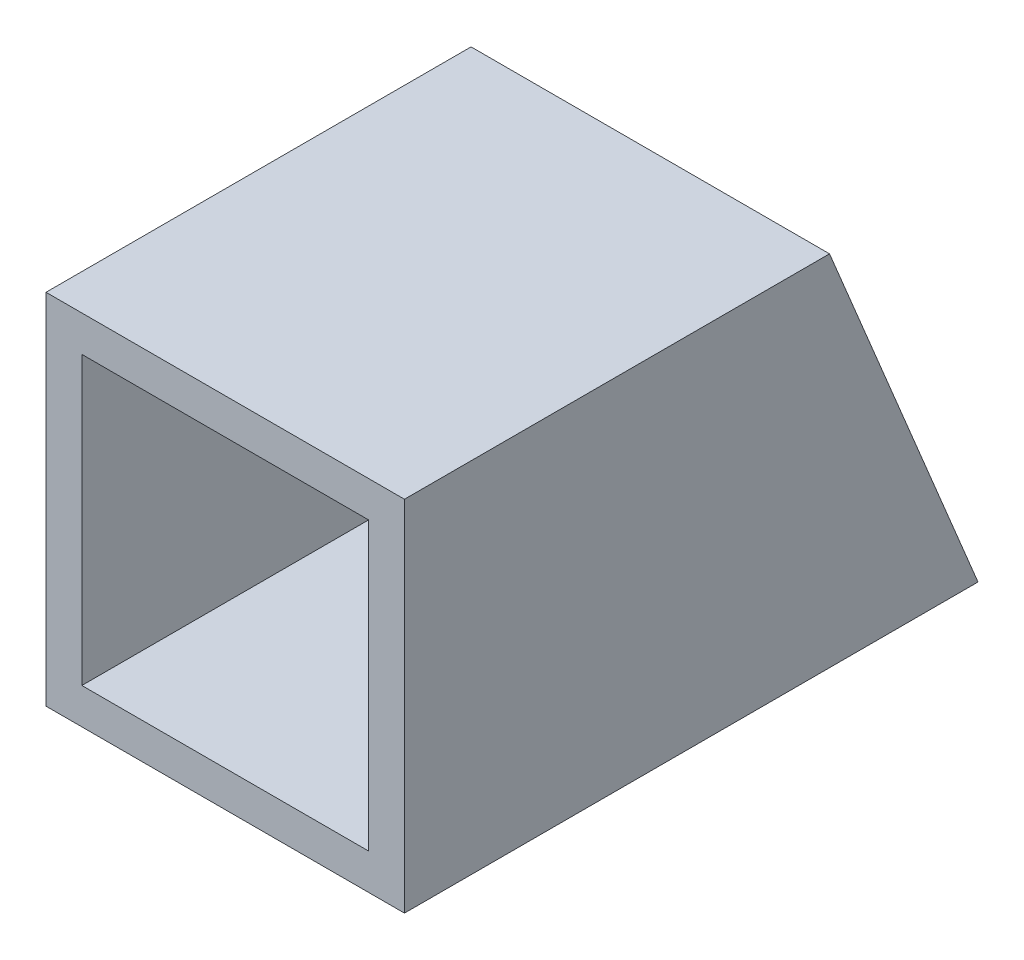
ISO-10303-21;
HEADER;
FILE_DESCRIPTION(('STEP AP214'),'2;1');
FILE_NAME('part.step','',(''),(''),'','','');
FILE_SCHEMA(('AUTOMOTIVE_DESIGN { 1 0 10303 214 1 1 1 1 }'));
ENDSEC;
DATA;
#1=APPLICATION_CONTEXT('core data for automotive mechanical design processes');
#2=APPLICATION_PROTOCOL_DEFINITION('international standard','automotive_design',2000,#1);
#3=PRODUCT_CONTEXT('',#1,'mechanical');
#4=PRODUCT('Part','Part','',(#3));
#5=PRODUCT_RELATED_PRODUCT_CATEGORY('part','',(#4));
#6=PRODUCT_DEFINITION_FORMATION('','',#4);
#7=PRODUCT_DEFINITION_CONTEXT('part definition',#1,'design');
#8=PRODUCT_DEFINITION('design','',#6,#7);
#9=PRODUCT_DEFINITION_SHAPE('','',#8);
#10=(LENGTH_UNIT() NAMED_UNIT(*) SI_UNIT(.MILLI.,.METRE.));
#11=(NAMED_UNIT(*) PLANE_ANGLE_UNIT() SI_UNIT($,.RADIAN.));
#12=(NAMED_UNIT(*) SI_UNIT($,.STERADIAN.) SOLID_ANGLE_UNIT());
#13=UNCERTAINTY_MEASURE_WITH_UNIT(LENGTH_MEASURE(1.E-05),#10,'distance_accuracy_value','');
#14=(GEOMETRIC_REPRESENTATION_CONTEXT(3) GLOBAL_UNCERTAINTY_ASSIGNED_CONTEXT((#13)) GLOBAL_UNIT_ASSIGNED_CONTEXT((#10,
#11,#12)) REPRESENTATION_CONTEXT('',''));
#15=CARTESIAN_POINT('',(0.,0.,0.));
#16=DIRECTION('',(0.,0.,1.));
#17=DIRECTION('',(1.,0.,0.));
#18=AXIS2_PLACEMENT_3D('',#15,#16,#17);
#19=CARTESIAN_POINT('',(31.75,31.75,0.));
#20=DIRECTION('',(0.,1.,0.));
#21=DIRECTION('',(0.,0.,1.));
#22=AXIS2_PLACEMENT_3D('',#19,#20,#21);
#23=PLANE('',#22);
#24=DIRECTION('',(0.,0.,-1.));
#25=VECTOR('',#24,1.);
#26=CARTESIAN_POINT('',(31.75,31.75,0.));
#27=LINE('',#26,#25);
#28=CARTESIAN_POINT('',(31.75,31.75,13.1512806053466));
#29=VERTEX_POINT('',#28);
#30=CARTESIAN_POINT('',(31.75,31.75,50.8));
#31=VERTEX_POINT('',#30);
#32=EDGE_CURVE('E113',#29,#31,#27,.F.);
#33=ORIENTED_EDGE('',*,*,#32,.F.);
#34=DIRECTION('',(1.,0.,0.));
#35=VECTOR('',#34,1.);
#36=CARTESIAN_POINT('',(31.75,31.75,13.1512806053466));
#37=LINE('',#36,#35);
#38=CARTESIAN_POINT('',(0.,31.75,13.1512806053466));
#39=VERTEX_POINT('',#38);
#40=EDGE_CURVE('E136',#29,#39,#37,.F.);
#41=ORIENTED_EDGE('',*,*,#40,.T.);
#42=DIRECTION('',(0.,0.,1.));
#43=VECTOR('',#42,1.);
#44=CARTESIAN_POINT('',(0.,31.75,0.));
#45=LINE('',#44,#43);
#46=CARTESIAN_POINT('',(0.,31.75,50.8));
#47=VERTEX_POINT('',#46);
#48=EDGE_CURVE('E130',#47,#39,#45,.F.);
#49=ORIENTED_EDGE('',*,*,#48,.F.);
#50=DIRECTION('',(1.,0.,0.));
#51=VECTOR('',#50,1.);
#52=CARTESIAN_POINT('',(0.,31.75,50.8));
#53=LINE('',#52,#51);
#54=EDGE_CURVE('E105',#31,#47,#53,.F.);
#55=ORIENTED_EDGE('',*,*,#54,.F.);
#56=EDGE_LOOP('',(#33,#41,#49,#55));
#57=FACE_BOUND('',#56,.T.);
#58=ADVANCED_FACE('F17',(#57),#23,.T.);
#59=CARTESIAN_POINT('',(28.575,28.575,0.));
#60=DIRECTION('',(-1.,0.,0.));
#61=DIRECTION('',(0.,0.,1.));
#62=AXIS2_PLACEMENT_3D('',#59,#60,#61);
#63=PLANE('',#62);
#64=DIRECTION('',(0.,0.,-1.));
#65=VECTOR('',#64,1.);
#66=CARTESIAN_POINT('',(28.575,28.575,0.));
#67=LINE('',#66,#65);
#68=CARTESIAN_POINT('',(28.575,28.5749999999999,11.8361525448107));
#69=VERTEX_POINT('',#68);
#70=CARTESIAN_POINT('',(28.575,28.575,50.8));
#71=VERTEX_POINT('',#70);
#72=EDGE_CURVE('E90',#69,#71,#67,.F.);
#73=ORIENTED_EDGE('',*,*,#72,.F.);
#74=DIRECTION('',(0.,-0.923879532511285,-0.382683432365094));
#75=VECTOR('',#74,1.);
#76=CARTESIAN_POINT('',(28.575,31.75,13.1512806053466));
#77=LINE('',#76,#75);
#78=CARTESIAN_POINT('',(28.575,3.17499999999995,1.31512806053478));
#79=VERTEX_POINT('',#78);
#80=EDGE_CURVE('E139',#69,#79,#77,.T.);
#81=ORIENTED_EDGE('',*,*,#80,.T.);
#82=DIRECTION('',(0.,0.,1.));
#83=VECTOR('',#82,1.);
#84=CARTESIAN_POINT('',(28.575,3.175,0.));
#85=LINE('',#84,#83);
#86=CARTESIAN_POINT('',(28.575,3.175,50.8));
#87=VERTEX_POINT('',#86);
#88=EDGE_CURVE('E20',#87,#79,#85,.F.);
#89=ORIENTED_EDGE('',*,*,#88,.F.);
#90=DIRECTION('',(0.,1.,0.));
#91=VECTOR('',#90,1.);
#92=CARTESIAN_POINT('',(28.575,0.,50.8));
#93=LINE('',#92,#91);
#94=EDGE_CURVE('E104',#71,#87,#93,.F.);
#95=ORIENTED_EDGE('',*,*,#94,.F.);
#96=EDGE_LOOP('',(#73,#81,#89,#95));
#97=FACE_BOUND('',#96,.T.);
#98=ADVANCED_FACE('F124',(#97),#63,.T.);
#99=CARTESIAN_POINT('',(28.575,3.175,0.));
#100=DIRECTION('',(0.,1.,0.));
#101=DIRECTION('',(0.,0.,1.));
#102=AXIS2_PLACEMENT_3D('',#99,#100,#101);
#103=PLANE('',#102);
#104=ORIENTED_EDGE('',*,*,#88,.T.);
#105=DIRECTION('',(1.,0.,0.));
#106=VECTOR('',#105,1.);
#107=CARTESIAN_POINT('',(31.75,3.1749999999998,1.31512806053514));
#108=LINE('',#107,#106);
#109=CARTESIAN_POINT('',(3.175,3.17499999999995,1.31512806053478));
#110=VERTEX_POINT('',#109);
#111=EDGE_CURVE('E87',#79,#110,#108,.F.);
#112=ORIENTED_EDGE('',*,*,#111,.T.);
#113=DIRECTION('',(0.,0.,-1.));
#114=VECTOR('',#113,1.);
#115=CARTESIAN_POINT('',(3.175,3.175,0.));
#116=LINE('',#115,#114);
#117=CARTESIAN_POINT('',(3.175,3.175,50.8));
#118=VERTEX_POINT('',#117);
#119=EDGE_CURVE('E79',#118,#110,#116,.T.);
#120=ORIENTED_EDGE('',*,*,#119,.F.);
#121=DIRECTION('',(1.,0.,0.));
#122=VECTOR('',#121,1.);
#123=CARTESIAN_POINT('',(0.,3.175,50.8));
#124=LINE('',#123,#122);
#125=EDGE_CURVE('E84',#87,#118,#124,.F.);
#126=ORIENTED_EDGE('',*,*,#125,.F.);
#127=EDGE_LOOP('',(#104,#112,#120,#126));
#128=FACE_BOUND('',#127,.T.);
#129=ADVANCED_FACE('F82',(#128),#103,.T.);
#130=CARTESIAN_POINT('',(3.175,3.175,0.));
#131=DIRECTION('',(1.,0.,0.));
#132=DIRECTION('',(0.,0.,-1.));
#133=AXIS2_PLACEMENT_3D('',#130,#131,#132);
#134=PLANE('',#133);
#135=ORIENTED_EDGE('',*,*,#119,.T.);
#136=DIRECTION('',(0.,-0.923879532511285,-0.382683432365094));
#137=VECTOR('',#136,1.);
#138=CARTESIAN_POINT('',(3.175,31.75,13.1512806053466));
#139=LINE('',#138,#137);
#140=CARTESIAN_POINT('',(3.175,28.5749999999999,11.8361525448107));
#141=VERTEX_POINT('',#140);
#142=EDGE_CURVE('E142',#110,#141,#139,.F.);
#143=ORIENTED_EDGE('',*,*,#142,.T.);
#144=DIRECTION('',(0.,0.,-1.));
#145=VECTOR('',#144,1.);
#146=CARTESIAN_POINT('',(3.175,28.575,0.));
#147=LINE('',#146,#145);
#148=CARTESIAN_POINT('',(3.175,28.575,50.8));
#149=VERTEX_POINT('',#148);
#150=EDGE_CURVE('E95',#149,#141,#147,.T.);
#151=ORIENTED_EDGE('',*,*,#150,.F.);
#152=DIRECTION('',(0.,1.,0.));
#153=VECTOR('',#152,1.);
#154=CARTESIAN_POINT('',(3.175,0.,50.8));
#155=LINE('',#154,#153);
#156=EDGE_CURVE('E92',#118,#149,#155,.T.);
#157=ORIENTED_EDGE('',*,*,#156,.F.);
#158=EDGE_LOOP('',(#135,#143,#151,#157));
#159=FACE_BOUND('',#158,.T.);
#160=ADVANCED_FACE('F93',(#159),#134,.T.);
#161=CARTESIAN_POINT('',(3.175,28.575,0.));
#162=DIRECTION('',(0.,-1.,0.));
#163=DIRECTION('',(0.,0.,-1.));
#164=AXIS2_PLACEMENT_3D('',#161,#162,#163);
#165=PLANE('',#164);
#166=ORIENTED_EDGE('',*,*,#150,.T.);
#167=DIRECTION('',(1.,0.,0.));
#168=VECTOR('',#167,1.);
#169=CARTESIAN_POINT('',(31.75,28.5749999999994,11.8361525448117));
#170=LINE('',#169,#168);
#171=EDGE_CURVE('E121',#141,#69,#170,.T.);
#172=ORIENTED_EDGE('',*,*,#171,.T.);
#173=ORIENTED_EDGE('',*,*,#72,.T.);
#174=DIRECTION('',(1.,0.,0.));
#175=VECTOR('',#174,1.);
#176=CARTESIAN_POINT('',(0.,28.575,50.8));
#177=LINE('',#176,#175);
#178=EDGE_CURVE('E99',#149,#71,#177,.T.);
#179=ORIENTED_EDGE('',*,*,#178,.F.);
#180=EDGE_LOOP('',(#166,#172,#173,#179));
#181=FACE_BOUND('',#180,.T.);
#182=ADVANCED_FACE('F119',(#181),#165,.T.);
#183=CARTESIAN_POINT('',(31.75,0.,0.));
#184=DIRECTION('',(1.,0.,0.));
#185=DIRECTION('',(0.,0.,-1.));
#186=AXIS2_PLACEMENT_3D('',#183,#184,#185);
#187=PLANE('',#186);
#188=DIRECTION('',(0.,0.,-1.));
#189=VECTOR('',#188,1.);
#190=CARTESIAN_POINT('',(31.75,0.,0.));
#191=LINE('',#190,#189);
#192=CARTESIAN_POINT('',(31.75,0.,1.34007388519208E-13));
#193=VERTEX_POINT('',#192);
#194=CARTESIAN_POINT('',(31.75,0.,50.8));
#195=VERTEX_POINT('',#194);
#196=EDGE_CURVE('E145',#193,#195,#191,.F.);
#197=ORIENTED_EDGE('',*,*,#196,.F.);
#198=DIRECTION('',(0.,-0.923879532511285,-0.382683432365094));
#199=VECTOR('',#198,1.);
#200=CARTESIAN_POINT('',(31.75,31.75,13.1512806053466));
#201=LINE('',#200,#199);
#202=EDGE_CURVE('E133',#193,#29,#201,.F.);
#203=ORIENTED_EDGE('',*,*,#202,.T.);
#204=ORIENTED_EDGE('',*,*,#32,.T.);
#205=DIRECTION('',(0.,1.,0.));
#206=VECTOR('',#205,1.);
#207=CARTESIAN_POINT('',(31.75,0.,50.8));
#208=LINE('',#207,#206);
#209=EDGE_CURVE('E107',#195,#31,#208,.T.);
#210=ORIENTED_EDGE('',*,*,#209,.F.);
#211=EDGE_LOOP('',(#197,#203,#204,#210));
#212=FACE_BOUND('',#211,.T.);
#213=ADVANCED_FACE('F164',(#212),#187,.T.);
#214=CARTESIAN_POINT('',(0.,0.,50.8));
#215=DIRECTION('',(0.,0.,1.));
#216=DIRECTION('',(1.,0.,0.));
#217=AXIS2_PLACEMENT_3D('',#214,#215,#216);
#218=PLANE('',#217);
#219=ORIENTED_EDGE('',*,*,#178,.T.);
#220=ORIENTED_EDGE('',*,*,#94,.T.);
#221=ORIENTED_EDGE('',*,*,#125,.T.);
#222=ORIENTED_EDGE('',*,*,#156,.T.);
#223=EDGE_LOOP('',(#219,#220,#221,#222));
#224=FACE_BOUND('',#223,.T.);
#225=DIRECTION('',(0.,1.,0.));
#226=VECTOR('',#225,1.);
#227=CARTESIAN_POINT('',(0.,31.75,50.8));
#228=LINE('',#227,#226);
#229=CARTESIAN_POINT('',(0.,0.,50.8));
#230=VERTEX_POINT('',#229);
#231=EDGE_CURVE('E125',#230,#47,#228,.T.);
#232=ORIENTED_EDGE('',*,*,#231,.F.);
#233=DIRECTION('',(1.,0.,0.));
#234=VECTOR('',#233,1.);
#235=CARTESIAN_POINT('',(0.,0.,50.8));
#236=LINE('',#235,#234);
#237=EDGE_CURVE('E148',#195,#230,#236,.F.);
#238=ORIENTED_EDGE('',*,*,#237,.F.);
#239=ORIENTED_EDGE('',*,*,#209,.T.);
#240=ORIENTED_EDGE('',*,*,#54,.T.);
#241=EDGE_LOOP('',(#232,#238,#239,#240));
#242=FACE_BOUND('',#241,.T.);
#243=ADVANCED_FACE('F101',(#224,#242),#218,.T.);
#244=CARTESIAN_POINT('',(0.,31.75,0.));
#245=DIRECTION('',(-1.,0.,0.));
#246=DIRECTION('',(0.,0.,1.));
#247=AXIS2_PLACEMENT_3D('',#244,#245,#246);
#248=PLANE('',#247);
#249=ORIENTED_EDGE('',*,*,#48,.T.);
#250=DIRECTION('',(0.,-0.923879532511285,-0.382683432365094));
#251=VECTOR('',#250,1.);
#252=CARTESIAN_POINT('',(0.,31.75,13.1512806053466));
#253=LINE('',#252,#251);
#254=CARTESIAN_POINT('',(0.,0.,1.33065618907584E-13));
#255=VERTEX_POINT('',#254);
#256=EDGE_CURVE('E35',#39,#255,#253,.T.);
#257=ORIENTED_EDGE('',*,*,#256,.T.);
#258=DIRECTION('',(0.,0.,-1.));
#259=VECTOR('',#258,1.);
#260=CARTESIAN_POINT('',(0.,0.,0.));
#261=LINE('',#260,#259);
#262=EDGE_CURVE('E26',#230,#255,#261,.T.);
#263=ORIENTED_EDGE('',*,*,#262,.F.);
#264=ORIENTED_EDGE('',*,*,#231,.T.);
#265=EDGE_LOOP('',(#249,#257,#263,#264));
#266=FACE_BOUND('',#265,.T.);
#267=ADVANCED_FACE('F155',(#266),#248,.T.);
#268=CARTESIAN_POINT('',(31.75,31.75,13.1512806053466));
#269=DIRECTION('',(0.,-0.382683432365094,0.923879532511285));
#270=DIRECTION('',(0.,-0.923879532511285,-0.382683432365094));
#271=AXIS2_PLACEMENT_3D('',#268,#269,#270);
#272=PLANE('',#271);
#273=ORIENTED_EDGE('',*,*,#142,.F.);
#274=ORIENTED_EDGE('',*,*,#111,.F.);
#275=ORIENTED_EDGE('',*,*,#80,.F.);
#276=ORIENTED_EDGE('',*,*,#171,.F.);
#277=EDGE_LOOP('',(#273,#274,#275,#276));
#278=FACE_BOUND('',#277,.T.);
#279=ORIENTED_EDGE('',*,*,#202,.F.);
#280=DIRECTION('',(1.,0.,0.));
#281=VECTOR('',#280,1.);
#282=CARTESIAN_POINT('',(0.,0.,0.));
#283=LINE('',#282,#281);
#284=EDGE_CURVE('E11',#255,#193,#283,.T.);
#285=ORIENTED_EDGE('',*,*,#284,.F.);
#286=ORIENTED_EDGE('',*,*,#256,.F.);
#287=ORIENTED_EDGE('',*,*,#40,.F.);
#288=EDGE_LOOP('',(#279,#285,#286,#287));
#289=FACE_BOUND('',#288,.T.);
#290=ADVANCED_FACE('F162',(#278,#289),#272,.F.);
#291=CARTESIAN_POINT('',(0.,0.,0.));
#292=DIRECTION('',(0.,-1.,0.));
#293=DIRECTION('',(0.,0.,-1.));
#294=AXIS2_PLACEMENT_3D('',#291,#292,#293);
#295=PLANE('',#294);
#296=ORIENTED_EDGE('',*,*,#262,.T.);
#297=ORIENTED_EDGE('',*,*,#284,.T.);
#298=ORIENTED_EDGE('',*,*,#196,.T.);
#299=ORIENTED_EDGE('',*,*,#237,.T.);
#300=EDGE_LOOP('',(#296,#297,#298,#299));
#301=FACE_BOUND('',#300,.T.);
#302=ADVANCED_FACE('F153',(#301),#295,.T.);
#303=CLOSED_SHELL('',(#58,#98,#129,#160,#182,#213,#243,#267,#290,#302));
#304=MANIFOLD_SOLID_BREP('B1',#303);
#305=ADVANCED_BREP_SHAPE_REPRESENTATION('',(#18,#304),#14);
#306=SHAPE_DEFINITION_REPRESENTATION(#9,#305);
ENDSEC;
END-ISO-10303-21;
